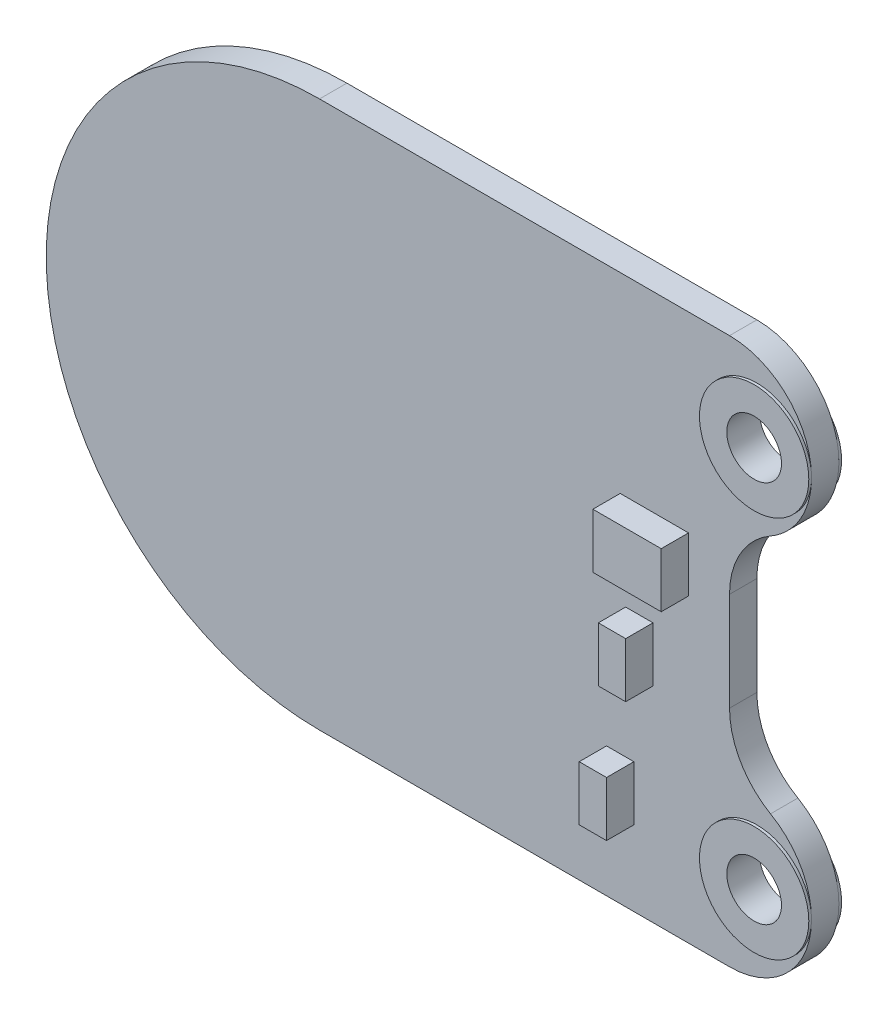
ISO-10303-21;
HEADER;
FILE_DESCRIPTION(('STEP AP214'),'2;1');
FILE_NAME('part.step','',(''),(''),'','','');
FILE_SCHEMA(('AUTOMOTIVE_DESIGN { 1 0 10303 214 1 1 1 1 }'));
ENDSEC;
DATA;
#1=APPLICATION_CONTEXT('core data for automotive mechanical design processes');
#2=APPLICATION_PROTOCOL_DEFINITION('international standard','automotive_design',2000,#1);
#3=PRODUCT_CONTEXT('',#1,'mechanical');
#4=PRODUCT('Part','Part','',(#3));
#5=PRODUCT_RELATED_PRODUCT_CATEGORY('part','',(#4));
#6=PRODUCT_DEFINITION_FORMATION('','',#4);
#7=PRODUCT_DEFINITION_CONTEXT('part definition',#1,'design');
#8=PRODUCT_DEFINITION('design','',#6,#7);
#9=PRODUCT_DEFINITION_SHAPE('','',#8);
#10=(LENGTH_UNIT() NAMED_UNIT(*) SI_UNIT(.MILLI.,.METRE.));
#11=(NAMED_UNIT(*) PLANE_ANGLE_UNIT() SI_UNIT($,.RADIAN.));
#12=(NAMED_UNIT(*) SI_UNIT($,.STERADIAN.) SOLID_ANGLE_UNIT());
#13=UNCERTAINTY_MEASURE_WITH_UNIT(LENGTH_MEASURE(1.E-05),#10,'distance_accuracy_value','');
#14=(GEOMETRIC_REPRESENTATION_CONTEXT(3) GLOBAL_UNCERTAINTY_ASSIGNED_CONTEXT((#13)) GLOBAL_UNIT_ASSIGNED_CONTEXT((#10,
#11,#12)) REPRESENTATION_CONTEXT('',''));
#15=CARTESIAN_POINT('',(0.,0.,0.));
#16=DIRECTION('',(0.,0.,1.));
#17=DIRECTION('',(1.,0.,0.));
#18=AXIS2_PLACEMENT_3D('',#15,#16,#17);
#19=CARTESIAN_POINT('',(11.,7.,1.));
#20=DIRECTION('',(0.,0.,1.));
#21=DIRECTION('',(1.,0.,0.));
#22=AXIS2_PLACEMENT_3D('',#19,#20,#21);
#23=PLANE('',#22);
#24=CARTESIAN_POINT('',(11.,-7.,1.));
#25=DIRECTION('',(0.,0.,1.));
#26=DIRECTION('',(1.,0.,0.));
#27=AXIS2_PLACEMENT_3D('',#24,#25,#26);
#28=CIRCLE('',#27,3.);
#29=CARTESIAN_POINT('',(11.,-10.,1.));
#30=VERTEX_POINT('',#29);
#31=CARTESIAN_POINT('',(14.,-7.,1.));
#32=VERTEX_POINT('',#31);
#33=EDGE_CURVE('E317',#30,#32,#28,.T.);
#34=ORIENTED_EDGE('',*,*,#33,.T.);
#35=CARTESIAN_POINT('',(12.,-7.,1.));
#36=DIRECTION('',(0.,0.,1.));
#37=DIRECTION('',(1.,0.,0.));
#38=AXIS2_PLACEMENT_3D('',#35,#36,#37);
#39=CIRCLE('',#38,2.);
#40=EDGE_CURVE('E291',#32,#32,#39,.T.);
#41=ORIENTED_EDGE('',*,*,#40,.F.);
#42=CARTESIAN_POINT('',(12.5,-4.40192378864668,1.));
#43=VERTEX_POINT('',#42);
#44=EDGE_CURVE('E316',#32,#43,#28,.T.);
#45=ORIENTED_EDGE('',*,*,#44,.T.);
#46=CARTESIAN_POINT('',(14.,-1.80384757729337,1.));
#47=DIRECTION('',(0.,0.,1.));
#48=DIRECTION('',(1.,0.,0.));
#49=AXIS2_PLACEMENT_3D('',#46,#47,#48);
#50=CIRCLE('',#49,3.);
#51=CARTESIAN_POINT('',(11.,-1.80384757729337,1.));
#52=VERTEX_POINT('',#51);
#53=EDGE_CURVE('E364',#43,#52,#50,.F.);
#54=ORIENTED_EDGE('',*,*,#53,.T.);
#55=DIRECTION('',(0.,1.,0.));
#56=VECTOR('',#55,1.);
#57=CARTESIAN_POINT('',(11.,4.,1.));
#58=LINE('',#57,#56);
#59=CARTESIAN_POINT('',(11.,1.80384757729337,1.));
#60=VERTEX_POINT('',#59);
#61=EDGE_CURVE('E319',#52,#60,#58,.T.);
#62=ORIENTED_EDGE('',*,*,#61,.T.);
#63=CARTESIAN_POINT('',(14.,1.80384757729337,1.));
#64=DIRECTION('',(0.,0.,1.));
#65=DIRECTION('',(1.,0.,0.));
#66=AXIS2_PLACEMENT_3D('',#63,#64,#65);
#67=CIRCLE('',#66,3.);
#68=CARTESIAN_POINT('',(12.5,4.40192378864669,1.));
#69=VERTEX_POINT('',#68);
#70=EDGE_CURVE('E11',#60,#69,#67,.F.);
#71=ORIENTED_EDGE('',*,*,#70,.T.);
#72=CARTESIAN_POINT('',(11.,7.,1.));
#73=DIRECTION('',(0.,0.,1.));
#74=DIRECTION('',(1.,0.,0.));
#75=AXIS2_PLACEMENT_3D('',#72,#73,#74);
#76=CIRCLE('',#75,3.);
#77=CARTESIAN_POINT('',(14.,7.,1.));
#78=VERTEX_POINT('',#77);
#79=EDGE_CURVE('E307',#69,#78,#76,.T.);
#80=ORIENTED_EDGE('',*,*,#79,.T.);
#81=CARTESIAN_POINT('',(12.,7.,1.));
#82=DIRECTION('',(0.,0.,1.));
#83=DIRECTION('',(1.,0.,0.));
#84=AXIS2_PLACEMENT_3D('',#81,#82,#83);
#85=CIRCLE('',#84,2.);
#86=EDGE_CURVE('E303',#78,#78,#85,.T.);
#87=ORIENTED_EDGE('',*,*,#86,.F.);
#88=CARTESIAN_POINT('',(11.,10.,1.));
#89=VERTEX_POINT('',#88);
#90=EDGE_CURVE('E310',#78,#89,#76,.T.);
#91=ORIENTED_EDGE('',*,*,#90,.T.);
#92=DIRECTION('',(-1.,0.,0.));
#93=VECTOR('',#92,1.);
#94=CARTESIAN_POINT('',(-4.,10.,1.));
#95=LINE('',#94,#93);
#96=CARTESIAN_POINT('',(-4.,10.,1.));
#97=VERTEX_POINT('',#96);
#98=EDGE_CURVE('E309',#89,#97,#95,.T.);
#99=ORIENTED_EDGE('',*,*,#98,.T.);
#100=CARTESIAN_POINT('',(-4.,0.,1.));
#101=DIRECTION('',(0.,0.,1.));
#102=DIRECTION('',(1.,0.,0.));
#103=AXIS2_PLACEMENT_3D('',#100,#101,#102);
#104=CIRCLE('',#103,10.);
#105=CARTESIAN_POINT('',(-4.,-10.,1.));
#106=VERTEX_POINT('',#105);
#107=EDGE_CURVE('E312',#97,#106,#104,.T.);
#108=ORIENTED_EDGE('',*,*,#107,.T.);
#109=DIRECTION('',(1.,0.,0.));
#110=VECTOR('',#109,1.);
#111=CARTESIAN_POINT('',(-4.,-10.,1.));
#112=LINE('',#111,#110);
#113=EDGE_CURVE('E314',#106,#30,#112,.T.);
#114=ORIENTED_EDGE('',*,*,#113,.T.);
#115=EDGE_LOOP('',(#34,#41,#45,#54,#62,#71,#80,#87,#91,#99,#108,#114));
#116=FACE_BOUND('',#115,.T.);
#117=DIRECTION('',(-1.,0.,0.));
#118=VECTOR('',#117,1.);
#119=CARTESIAN_POINT('',(7.,3.,1.));
#120=LINE('',#119,#118);
#121=CARTESIAN_POINT('',(9.50000000000001,3.,1.));
#122=VERTEX_POINT('',#121);
#123=CARTESIAN_POINT('',(7.,3.,1.));
#124=VERTEX_POINT('',#123);
#125=EDGE_CURVE('E258',#122,#124,#120,.T.);
#126=ORIENTED_EDGE('',*,*,#125,.F.);
#127=DIRECTION('',(0.,1.,0.));
#128=VECTOR('',#127,1.);
#129=CARTESIAN_POINT('',(9.50000000000001,3.,1.));
#130=LINE('',#129,#128);
#131=CARTESIAN_POINT('',(9.50000000000001,1.,1.));
#132=VERTEX_POINT('',#131);
#133=EDGE_CURVE('E244',#132,#122,#130,.T.);
#134=ORIENTED_EDGE('',*,*,#133,.F.);
#135=DIRECTION('',(1.,0.,0.));
#136=VECTOR('',#135,1.);
#137=CARTESIAN_POINT('',(7.,1.,1.));
#138=LINE('',#137,#136);
#139=CARTESIAN_POINT('',(7.,1.,1.));
#140=VERTEX_POINT('',#139);
#141=EDGE_CURVE('E249',#140,#132,#138,.T.);
#142=ORIENTED_EDGE('',*,*,#141,.F.);
#143=DIRECTION('',(0.,-1.,0.));
#144=VECTOR('',#143,1.);
#145=CARTESIAN_POINT('',(7.,3.,1.));
#146=LINE('',#145,#144);
#147=EDGE_CURVE('E260',#124,#140,#146,.T.);
#148=ORIENTED_EDGE('',*,*,#147,.F.);
#149=EDGE_LOOP('',(#126,#134,#142,#148));
#150=FACE_BOUND('',#149,.T.);
#151=DIRECTION('',(-1.,0.,0.));
#152=VECTOR('',#151,1.);
#153=CARTESIAN_POINT('',(7.2,-0.499999999999999,1.));
#154=LINE('',#153,#152);
#155=CARTESIAN_POINT('',(8.2,-0.499999999999999,1.));
#156=VERTEX_POINT('',#155);
#157=CARTESIAN_POINT('',(7.2,-0.499999999999999,1.));
#158=VERTEX_POINT('',#157);
#159=EDGE_CURVE('E216',#156,#158,#154,.T.);
#160=ORIENTED_EDGE('',*,*,#159,.F.);
#161=DIRECTION('',(0.,1.,0.));
#162=VECTOR('',#161,1.);
#163=CARTESIAN_POINT('',(8.2,-0.499999999999999,1.));
#164=LINE('',#163,#162);
#165=CARTESIAN_POINT('',(8.2,-2.5,1.));
#166=VERTEX_POINT('',#165);
#167=EDGE_CURVE('E213',#166,#156,#164,.T.);
#168=ORIENTED_EDGE('',*,*,#167,.F.);
#169=DIRECTION('',(1.,0.,0.));
#170=VECTOR('',#169,1.);
#171=CARTESIAN_POINT('',(7.2,-2.5,1.));
#172=LINE('',#171,#170);
#173=CARTESIAN_POINT('',(7.2,-2.5,1.));
#174=VERTEX_POINT('',#173);
#175=EDGE_CURVE('E225',#174,#166,#172,.T.);
#176=ORIENTED_EDGE('',*,*,#175,.F.);
#177=DIRECTION('',(0.,-1.,0.));
#178=VECTOR('',#177,1.);
#179=CARTESIAN_POINT('',(7.2,-0.499999999999999,1.));
#180=LINE('',#179,#178);
#181=EDGE_CURVE('E233',#158,#174,#180,.T.);
#182=ORIENTED_EDGE('',*,*,#181,.F.);
#183=EDGE_LOOP('',(#160,#168,#176,#182));
#184=FACE_BOUND('',#183,.T.);
#185=DIRECTION('',(-1.,0.,0.));
#186=VECTOR('',#185,1.);
#187=CARTESIAN_POINT('',(6.50000000000001,-5.25,1.));
#188=LINE('',#187,#186);
#189=CARTESIAN_POINT('',(7.50000000000001,-5.25,1.));
#190=VERTEX_POINT('',#189);
#191=CARTESIAN_POINT('',(6.50000000000001,-5.25,1.));
#192=VERTEX_POINT('',#191);
#193=EDGE_CURVE('E757',#190,#192,#188,.T.);
#194=ORIENTED_EDGE('',*,*,#193,.F.);
#195=DIRECTION('',(0.,1.,0.));
#196=VECTOR('',#195,1.);
#197=CARTESIAN_POINT('',(7.50000000000001,-5.25,1.));
#198=LINE('',#197,#196);
#199=CARTESIAN_POINT('',(7.50000000000001,-7.25,1.));
#200=VERTEX_POINT('',#199);
#201=EDGE_CURVE('E211',#200,#190,#198,.T.);
#202=ORIENTED_EDGE('',*,*,#201,.F.);
#203=DIRECTION('',(1.,0.,0.));
#204=VECTOR('',#203,1.);
#205=CARTESIAN_POINT('',(6.50000000000001,-7.25,1.));
#206=LINE('',#205,#204);
#207=CARTESIAN_POINT('',(6.50000000000001,-7.25,1.));
#208=VERTEX_POINT('',#207);
#209=EDGE_CURVE('E207',#208,#200,#206,.T.);
#210=ORIENTED_EDGE('',*,*,#209,.F.);
#211=DIRECTION('',(0.,-1.,0.));
#212=VECTOR('',#211,1.);
#213=CARTESIAN_POINT('',(6.50000000000001,-5.25,1.));
#214=LINE('',#213,#212);
#215=EDGE_CURVE('E754',#192,#208,#214,.T.);
#216=ORIENTED_EDGE('',*,*,#215,.F.);
#217=EDGE_LOOP('',(#194,#202,#210,#216));
#218=FACE_BOUND('',#217,.T.);
#219=ADVANCED_FACE('F38',(#116,#150,#184,#218),#23,.T.);
#220=CARTESIAN_POINT('',(12.,7.,-0.1));
#221=DIRECTION('',(0.,0.,1.));
#222=DIRECTION('',(1.,0.,0.));
#223=AXIS2_PLACEMENT_3D('',#220,#221,#222);
#224=CYLINDRICAL_SURFACE('',#223,2.);
#225=ORIENTED_EDGE('',*,*,#86,.T.);
#226=EDGE_LOOP('',(#225));
#227=FACE_BOUND('',#226,.T.);
#228=CARTESIAN_POINT('',(12.,7.,1.1));
#229=DIRECTION('',(0.,0.,1.));
#230=DIRECTION('',(1.,0.,0.));
#231=AXIS2_PLACEMENT_3D('',#228,#229,#230);
#232=CIRCLE('',#231,2.);
#233=CARTESIAN_POINT('',(14.,7.,1.1));
#234=VERTEX_POINT('',#233);
#235=EDGE_CURVE('E294',#234,#234,#232,.T.);
#236=ORIENTED_EDGE('',*,*,#235,.F.);
#237=EDGE_LOOP('',(#236));
#238=FACE_BOUND('',#237,.T.);
#239=ADVANCED_FACE('F389',(#227,#238),#224,.T.);
#240=CARTESIAN_POINT('',(12.,7.,1.1));
#241=DIRECTION('',(0.,0.,1.));
#242=DIRECTION('',(1.,0.,0.));
#243=AXIS2_PLACEMENT_3D('',#240,#241,#242);
#244=PLANE('',#243);
#245=CARTESIAN_POINT('',(12.,7.,1.1));
#246=DIRECTION('',(0.,0.,1.));
#247=DIRECTION('',(1.,0.,0.));
#248=AXIS2_PLACEMENT_3D('',#245,#246,#247);
#249=CIRCLE('',#248,1.);
#250=CARTESIAN_POINT('',(13.,7.,1.1));
#251=VERTEX_POINT('',#250);
#252=EDGE_CURVE('E274',#251,#251,#249,.T.);
#253=ORIENTED_EDGE('',*,*,#252,.F.);
#254=EDGE_LOOP('',(#253));
#255=FACE_BOUND('',#254,.T.);
#256=ORIENTED_EDGE('',*,*,#235,.T.);
#257=EDGE_LOOP('',(#256));
#258=FACE_BOUND('',#257,.T.);
#259=ADVANCED_FACE('F392',(#255,#258),#244,.T.);
#260=CARTESIAN_POINT('',(11.,7.,0.));
#261=DIRECTION('',(0.,0.,1.));
#262=DIRECTION('',(1.,0.,0.));
#263=AXIS2_PLACEMENT_3D('',#260,#261,#262);
#264=PLANE('',#263);
#265=CARTESIAN_POINT('',(11.,-7.,0.));
#266=DIRECTION('',(0.,0.,1.));
#267=DIRECTION('',(1.,0.,0.));
#268=AXIS2_PLACEMENT_3D('',#265,#266,#267);
#269=CIRCLE('',#268,3.);
#270=CARTESIAN_POINT('',(14.,-7.,0.));
#271=VERTEX_POINT('',#270);
#272=CARTESIAN_POINT('',(12.5,-4.40192378864668,0.));
#273=VERTEX_POINT('',#272);
#274=EDGE_CURVE('E332',#271,#273,#269,.T.);
#275=ORIENTED_EDGE('',*,*,#274,.F.);
#276=CARTESIAN_POINT('',(12.,-7.,0.));
#277=DIRECTION('',(0.,0.,1.));
#278=DIRECTION('',(1.,0.,0.));
#279=AXIS2_PLACEMENT_3D('',#276,#277,#278);
#280=CIRCLE('',#279,2.);
#281=EDGE_CURVE('E288',#271,#271,#280,.T.);
#282=ORIENTED_EDGE('',*,*,#281,.T.);
#283=CARTESIAN_POINT('',(11.,-10.,0.));
#284=VERTEX_POINT('',#283);
#285=EDGE_CURVE('E333',#284,#271,#269,.T.);
#286=ORIENTED_EDGE('',*,*,#285,.F.);
#287=DIRECTION('',(1.,0.,0.));
#288=VECTOR('',#287,1.);
#289=CARTESIAN_POINT('',(-4.,-10.,0.));
#290=LINE('',#289,#288);
#291=CARTESIAN_POINT('',(-4.,-10.,0.));
#292=VERTEX_POINT('',#291);
#293=EDGE_CURVE('E330',#292,#284,#290,.T.);
#294=ORIENTED_EDGE('',*,*,#293,.F.);
#295=CARTESIAN_POINT('',(-4.,0.,0.));
#296=DIRECTION('',(0.,0.,1.));
#297=DIRECTION('',(1.,0.,0.));
#298=AXIS2_PLACEMENT_3D('',#295,#296,#297);
#299=CIRCLE('',#298,10.);
#300=CARTESIAN_POINT('',(-4.,10.,0.));
#301=VERTEX_POINT('',#300);
#302=EDGE_CURVE('E328',#301,#292,#299,.T.);
#303=ORIENTED_EDGE('',*,*,#302,.F.);
#304=DIRECTION('',(-1.,0.,0.));
#305=VECTOR('',#304,1.);
#306=CARTESIAN_POINT('',(-4.,10.,0.));
#307=LINE('',#306,#305);
#308=CARTESIAN_POINT('',(11.,10.,0.));
#309=VERTEX_POINT('',#308);
#310=EDGE_CURVE('E326',#309,#301,#307,.T.);
#311=ORIENTED_EDGE('',*,*,#310,.F.);
#312=CARTESIAN_POINT('',(11.,7.,0.));
#313=DIRECTION('',(0.,0.,1.));
#314=DIRECTION('',(1.,0.,0.));
#315=AXIS2_PLACEMENT_3D('',#312,#313,#314);
#316=CIRCLE('',#315,3.);
#317=CARTESIAN_POINT('',(14.,7.,0.));
#318=VERTEX_POINT('',#317);
#319=EDGE_CURVE('E306',#318,#309,#316,.T.);
#320=ORIENTED_EDGE('',*,*,#319,.F.);
#321=CARTESIAN_POINT('',(12.,7.,0.));
#322=DIRECTION('',(0.,0.,1.));
#323=DIRECTION('',(1.,0.,0.));
#324=AXIS2_PLACEMENT_3D('',#321,#322,#323);
#325=CIRCLE('',#324,2.);
#326=EDGE_CURVE('E300',#318,#318,#325,.T.);
#327=ORIENTED_EDGE('',*,*,#326,.T.);
#328=CARTESIAN_POINT('',(12.5,4.40192378864669,0.));
#329=VERTEX_POINT('',#328);
#330=EDGE_CURVE('E323',#329,#318,#316,.T.);
#331=ORIENTED_EDGE('',*,*,#330,.F.);
#332=CARTESIAN_POINT('',(14.,1.80384757729337,0.));
#333=DIRECTION('',(0.,0.,1.));
#334=DIRECTION('',(1.,0.,0.));
#335=AXIS2_PLACEMENT_3D('',#332,#333,#334);
#336=CIRCLE('',#335,3.);
#337=CARTESIAN_POINT('',(11.,1.80384757729337,0.));
#338=VERTEX_POINT('',#337);
#339=EDGE_CURVE('E47',#329,#338,#336,.T.);
#340=ORIENTED_EDGE('',*,*,#339,.T.);
#341=DIRECTION('',(0.,1.,0.));
#342=VECTOR('',#341,1.);
#343=CARTESIAN_POINT('',(11.,4.,0.));
#344=LINE('',#343,#342);
#345=CARTESIAN_POINT('',(11.,-1.80384757729337,0.));
#346=VERTEX_POINT('',#345);
#347=EDGE_CURVE('E336',#346,#338,#344,.T.);
#348=ORIENTED_EDGE('',*,*,#347,.F.);
#349=CARTESIAN_POINT('',(14.,-1.80384757729337,0.));
#350=DIRECTION('',(0.,0.,1.));
#351=DIRECTION('',(1.,0.,0.));
#352=AXIS2_PLACEMENT_3D('',#349,#350,#351);
#353=CIRCLE('',#352,3.);
#354=EDGE_CURVE('E361',#346,#273,#353,.T.);
#355=ORIENTED_EDGE('',*,*,#354,.T.);
#356=EDGE_LOOP('',(#275,#282,#286,#294,#303,#311,#320,#327,#331,#340,#348,#355));
#357=FACE_BOUND('',#356,.T.);
#358=ADVANCED_FACE('F370',(#357),#264,.F.);
#359=CARTESIAN_POINT('',(11.,7.,1.));
#360=DIRECTION('',(0.,0.,-1.));
#361=DIRECTION('',(-1.,0.,0.));
#362=AXIS2_PLACEMENT_3D('',#359,#360,#361);
#363=CYLINDRICAL_SURFACE('',#362,3.);
#364=ORIENTED_EDGE('',*,*,#330,.T.);
#365=ORIENTED_EDGE('',*,*,#319,.T.);
#366=DIRECTION('',(0.,0.,-1.));
#367=VECTOR('',#366,1.);
#368=CARTESIAN_POINT('',(11.,10.,1.));
#369=LINE('',#368,#367);
#370=EDGE_CURVE('E347',#89,#309,#369,.T.);
#371=ORIENTED_EDGE('',*,*,#370,.F.);
#372=ORIENTED_EDGE('',*,*,#90,.F.);
#373=ORIENTED_EDGE('',*,*,#79,.F.);
#374=DIRECTION('',(0.,0.,-1.));
#375=VECTOR('',#374,1.);
#376=CARTESIAN_POINT('',(12.5,4.40192378864669,1.));
#377=LINE('',#376,#375);
#378=EDGE_CURVE('E358',#69,#329,#377,.T.);
#379=ORIENTED_EDGE('',*,*,#378,.T.);
#380=EDGE_LOOP('',(#364,#365,#371,#372,#373,#379));
#381=FACE_BOUND('',#380,.T.);
#382=ADVANCED_FACE('F385',(#381),#363,.T.);
#383=CARTESIAN_POINT('',(-4.,10.,1.));
#384=DIRECTION('',(0.,-1.,0.));
#385=DIRECTION('',(0.,0.,-1.));
#386=AXIS2_PLACEMENT_3D('',#383,#384,#385);
#387=PLANE('',#386);
#388=ORIENTED_EDGE('',*,*,#310,.T.);
#389=DIRECTION('',(0.,0.,-1.));
#390=VECTOR('',#389,1.);
#391=CARTESIAN_POINT('',(-4.,10.,1.));
#392=LINE('',#391,#390);
#393=EDGE_CURVE('E344',#97,#301,#392,.T.);
#394=ORIENTED_EDGE('',*,*,#393,.F.);
#395=ORIENTED_EDGE('',*,*,#98,.F.);
#396=ORIENTED_EDGE('',*,*,#370,.T.);
#397=EDGE_LOOP('',(#388,#394,#395,#396));
#398=FACE_BOUND('',#397,.T.);
#399=ADVANCED_FACE('F426',(#398),#387,.F.);
#400=CARTESIAN_POINT('',(-4.,0.,1.));
#401=DIRECTION('',(0.,0.,-1.));
#402=DIRECTION('',(-1.,0.,0.));
#403=AXIS2_PLACEMENT_3D('',#400,#401,#402);
#404=CYLINDRICAL_SURFACE('',#403,10.);
#405=ORIENTED_EDGE('',*,*,#302,.T.);
#406=DIRECTION('',(0.,0.,-1.));
#407=VECTOR('',#406,1.);
#408=CARTESIAN_POINT('',(-4.,-10.,1.));
#409=LINE('',#408,#407);
#410=EDGE_CURVE('E341',#106,#292,#409,.T.);
#411=ORIENTED_EDGE('',*,*,#410,.F.);
#412=ORIENTED_EDGE('',*,*,#107,.F.);
#413=ORIENTED_EDGE('',*,*,#393,.T.);
#414=EDGE_LOOP('',(#405,#411,#412,#413));
#415=FACE_BOUND('',#414,.T.);
#416=ADVANCED_FACE('F422',(#415),#404,.T.);
#417=CARTESIAN_POINT('',(-4.,-10.,1.));
#418=DIRECTION('',(0.,1.,0.));
#419=DIRECTION('',(0.,0.,1.));
#420=AXIS2_PLACEMENT_3D('',#417,#418,#419);
#421=PLANE('',#420);
#422=ORIENTED_EDGE('',*,*,#293,.T.);
#423=DIRECTION('',(0.,0.,-1.));
#424=VECTOR('',#423,1.);
#425=CARTESIAN_POINT('',(11.,-10.,1.));
#426=LINE('',#425,#424);
#427=EDGE_CURVE('E322',#30,#284,#426,.T.);
#428=ORIENTED_EDGE('',*,*,#427,.F.);
#429=ORIENTED_EDGE('',*,*,#113,.F.);
#430=ORIENTED_EDGE('',*,*,#410,.T.);
#431=EDGE_LOOP('',(#422,#428,#429,#430));
#432=FACE_BOUND('',#431,.T.);
#433=ADVANCED_FACE('F418',(#432),#421,.F.);
#434=CARTESIAN_POINT('',(11.,-7.,1.));
#435=DIRECTION('',(0.,0.,-1.));
#436=DIRECTION('',(-1.,0.,0.));
#437=AXIS2_PLACEMENT_3D('',#434,#435,#436);
#438=CYLINDRICAL_SURFACE('',#437,3.);
#439=ORIENTED_EDGE('',*,*,#285,.T.);
#440=ORIENTED_EDGE('',*,*,#274,.T.);
#441=DIRECTION('',(0.,0.,-1.));
#442=VECTOR('',#441,1.);
#443=CARTESIAN_POINT('',(12.5,-4.40192378864668,1.));
#444=LINE('',#443,#442);
#445=EDGE_CURVE('E355',#273,#43,#444,.F.);
#446=ORIENTED_EDGE('',*,*,#445,.T.);
#447=ORIENTED_EDGE('',*,*,#44,.F.);
#448=ORIENTED_EDGE('',*,*,#33,.F.);
#449=ORIENTED_EDGE('',*,*,#427,.T.);
#450=EDGE_LOOP('',(#439,#440,#446,#447,#448,#449));
#451=FACE_BOUND('',#450,.T.);
#452=ADVANCED_FACE('F415',(#451),#438,.T.);
#453=CARTESIAN_POINT('',(11.,4.,1.));
#454=DIRECTION('',(-1.,0.,0.));
#455=DIRECTION('',(0.,-1.,0.));
#456=AXIS2_PLACEMENT_3D('',#453,#454,#455);
#457=PLANE('',#456);
#458=ORIENTED_EDGE('',*,*,#61,.F.);
#459=DIRECTION('',(0.,0.,1.));
#460=VECTOR('',#459,1.);
#461=CARTESIAN_POINT('',(11.,-1.80384757729337,0.));
#462=LINE('',#461,#460);
#463=EDGE_CURVE('E352',#52,#346,#462,.F.);
#464=ORIENTED_EDGE('',*,*,#463,.T.);
#465=ORIENTED_EDGE('',*,*,#347,.T.);
#466=DIRECTION('',(0.,0.,1.));
#467=VECTOR('',#466,1.);
#468=CARTESIAN_POINT('',(11.,1.80384757729337,1.));
#469=LINE('',#468,#467);
#470=EDGE_CURVE('E350',#338,#60,#469,.T.);
#471=ORIENTED_EDGE('',*,*,#470,.T.);
#472=EDGE_LOOP('',(#458,#464,#465,#471));
#473=FACE_BOUND('',#472,.T.);
#474=ADVANCED_FACE('F376',(#473),#457,.F.);
#475=CARTESIAN_POINT('',(14.,-1.80384757729337,1.));
#476=DIRECTION('',(0.,0.,-1.));
#477=DIRECTION('',(-1.,0.,0.));
#478=AXIS2_PLACEMENT_3D('',#475,#476,#477);
#479=CYLINDRICAL_SURFACE('',#478,3.);
#480=ORIENTED_EDGE('',*,*,#53,.F.);
#481=ORIENTED_EDGE('',*,*,#445,.F.);
#482=ORIENTED_EDGE('',*,*,#354,.F.);
#483=ORIENTED_EDGE('',*,*,#463,.F.);
#484=EDGE_LOOP('',(#480,#481,#482,#483));
#485=FACE_BOUND('',#484,.T.);
#486=ADVANCED_FACE('F414',(#485),#479,.F.);
#487=CARTESIAN_POINT('',(14.,1.80384757729337,1.));
#488=DIRECTION('',(0.,0.,-1.));
#489=DIRECTION('',(-1.,0.,0.));
#490=AXIS2_PLACEMENT_3D('',#487,#488,#489);
#491=CYLINDRICAL_SURFACE('',#490,3.);
#492=ORIENTED_EDGE('',*,*,#70,.F.);
#493=ORIENTED_EDGE('',*,*,#470,.F.);
#494=ORIENTED_EDGE('',*,*,#339,.F.);
#495=ORIENTED_EDGE('',*,*,#378,.F.);
#496=EDGE_LOOP('',(#492,#493,#494,#495));
#497=FACE_BOUND('',#496,.T.);
#498=ADVANCED_FACE('F40',(#497),#491,.F.);
#499=CARTESIAN_POINT('',(12.,7.,-0.1));
#500=DIRECTION('',(0.,0.,1.));
#501=DIRECTION('',(1.,0.,0.));
#502=AXIS2_PLACEMENT_3D('',#499,#500,#501);
#503=PLANE('',#502);
#504=CARTESIAN_POINT('',(12.,7.,-0.1));
#505=DIRECTION('',(0.,0.,1.));
#506=DIRECTION('',(1.,0.,0.));
#507=AXIS2_PLACEMENT_3D('',#504,#505,#506);
#508=CIRCLE('',#507,1.);
#509=CARTESIAN_POINT('',(13.,7.,-0.1));
#510=VERTEX_POINT('',#509);
#511=EDGE_CURVE('E42',#510,#510,#508,.T.);
#512=ORIENTED_EDGE('',*,*,#511,.T.);
#513=EDGE_LOOP('',(#512));
#514=FACE_BOUND('',#513,.T.);
#515=CARTESIAN_POINT('',(12.,7.,-0.1));
#516=DIRECTION('',(0.,0.,1.));
#517=DIRECTION('',(1.,0.,0.));
#518=AXIS2_PLACEMENT_3D('',#515,#516,#517);
#519=CIRCLE('',#518,2.);
#520=CARTESIAN_POINT('',(14.,7.,-0.1));
#521=VERTEX_POINT('',#520);
#522=EDGE_CURVE('E297',#521,#521,#519,.T.);
#523=ORIENTED_EDGE('',*,*,#522,.F.);
#524=EDGE_LOOP('',(#523));
#525=FACE_BOUND('',#524,.T.);
#526=ADVANCED_FACE('F437',(#514,#525),#503,.F.);
#527=ORIENTED_EDGE('',*,*,#522,.T.);
#528=EDGE_LOOP('',(#527));
#529=FACE_BOUND('',#528,.T.);
#530=ORIENTED_EDGE('',*,*,#326,.F.);
#531=EDGE_LOOP('',(#530));
#532=FACE_BOUND('',#531,.T.);
#533=ADVANCED_FACE('F394',(#529,#532),#224,.T.);
#534=CARTESIAN_POINT('',(12.,-7.,-0.1));
#535=DIRECTION('',(0.,0.,1.));
#536=DIRECTION('',(1.,0.,0.));
#537=AXIS2_PLACEMENT_3D('',#534,#535,#536);
#538=PLANE('',#537);
#539=CARTESIAN_POINT('',(12.,-7.,-0.1));
#540=DIRECTION('',(0.,0.,1.));
#541=DIRECTION('',(1.,0.,0.));
#542=AXIS2_PLACEMENT_3D('',#539,#540,#541);
#543=CIRCLE('',#542,1.);
#544=CARTESIAN_POINT('',(13.,-7.,-0.1));
#545=VERTEX_POINT('',#544);
#546=EDGE_CURVE('E277',#545,#545,#543,.T.);
#547=ORIENTED_EDGE('',*,*,#546,.T.);
#548=EDGE_LOOP('',(#547));
#549=FACE_BOUND('',#548,.T.);
#550=CARTESIAN_POINT('',(12.,-7.,-0.1));
#551=DIRECTION('',(0.,0.,1.));
#552=DIRECTION('',(1.,0.,0.));
#553=AXIS2_PLACEMENT_3D('',#550,#551,#552);
#554=CIRCLE('',#553,2.);
#555=CARTESIAN_POINT('',(14.,-7.,-0.1));
#556=VERTEX_POINT('',#555);
#557=EDGE_CURVE('E282',#556,#556,#554,.T.);
#558=ORIENTED_EDGE('',*,*,#557,.F.);
#559=EDGE_LOOP('',(#558));
#560=FACE_BOUND('',#559,.T.);
#561=ADVANCED_FACE('F449',(#549,#560),#538,.F.);
#562=CARTESIAN_POINT('',(12.,-7.,-0.1));
#563=DIRECTION('',(0.,0.,1.));
#564=DIRECTION('',(1.,0.,0.));
#565=AXIS2_PLACEMENT_3D('',#562,#563,#564);
#566=CYLINDRICAL_SURFACE('',#565,2.);
#567=ORIENTED_EDGE('',*,*,#557,.T.);
#568=EDGE_LOOP('',(#567));
#569=FACE_BOUND('',#568,.T.);
#570=ORIENTED_EDGE('',*,*,#281,.F.);
#571=EDGE_LOOP('',(#570));
#572=FACE_BOUND('',#571,.T.);
#573=ADVANCED_FACE('F446',(#569,#572),#566,.T.);
#574=ORIENTED_EDGE('',*,*,#40,.T.);
#575=EDGE_LOOP('',(#574));
#576=FACE_BOUND('',#575,.T.);
#577=CARTESIAN_POINT('',(12.,-7.,1.1));
#578=DIRECTION('',(0.,0.,1.));
#579=DIRECTION('',(1.,0.,0.));
#580=AXIS2_PLACEMENT_3D('',#577,#578,#579);
#581=CIRCLE('',#580,2.);
#582=CARTESIAN_POINT('',(14.,-7.,1.1));
#583=VERTEX_POINT('',#582);
#584=EDGE_CURVE('E285',#583,#583,#581,.T.);
#585=ORIENTED_EDGE('',*,*,#584,.F.);
#586=EDGE_LOOP('',(#585));
#587=FACE_BOUND('',#586,.T.);
#588=ADVANCED_FACE('F448',(#576,#587),#566,.T.);
#589=CARTESIAN_POINT('',(12.,-7.,1.1));
#590=DIRECTION('',(0.,0.,1.));
#591=DIRECTION('',(1.,0.,0.));
#592=AXIS2_PLACEMENT_3D('',#589,#590,#591);
#593=PLANE('',#592);
#594=CARTESIAN_POINT('',(12.,-7.,1.1));
#595=DIRECTION('',(0.,0.,1.));
#596=DIRECTION('',(1.,0.,0.));
#597=AXIS2_PLACEMENT_3D('',#594,#595,#596);
#598=CIRCLE('',#597,1.);
#599=CARTESIAN_POINT('',(13.,-7.,1.1));
#600=VERTEX_POINT('',#599);
#601=EDGE_CURVE('E273',#600,#600,#598,.T.);
#602=ORIENTED_EDGE('',*,*,#601,.F.);
#603=EDGE_LOOP('',(#602));
#604=FACE_BOUND('',#603,.T.);
#605=ORIENTED_EDGE('',*,*,#584,.T.);
#606=EDGE_LOOP('',(#605));
#607=FACE_BOUND('',#606,.T.);
#608=ADVANCED_FACE('F456',(#604,#607),#593,.T.);
#609=CARTESIAN_POINT('',(12.,-7.,-0.9));
#610=DIRECTION('',(0.,0.,1.));
#611=DIRECTION('',(1.,0.,0.));
#612=AXIS2_PLACEMENT_3D('',#609,#610,#611);
#613=CYLINDRICAL_SURFACE('',#612,1.);
#614=ORIENTED_EDGE('',*,*,#601,.T.);
#615=EDGE_LOOP('',(#614));
#616=FACE_BOUND('',#615,.T.);
#617=ORIENTED_EDGE('',*,*,#546,.F.);
#618=EDGE_LOOP('',(#617));
#619=FACE_BOUND('',#618,.T.);
#620=ADVANCED_FACE('F461',(#616,#619),#613,.F.);
#621=CARTESIAN_POINT('',(12.,7.,-0.9));
#622=DIRECTION('',(0.,0.,1.));
#623=DIRECTION('',(1.,0.,0.));
#624=AXIS2_PLACEMENT_3D('',#621,#622,#623);
#625=CYLINDRICAL_SURFACE('',#624,1.);
#626=ORIENTED_EDGE('',*,*,#252,.T.);
#627=EDGE_LOOP('',(#626));
#628=FACE_BOUND('',#627,.T.);
#629=ORIENTED_EDGE('',*,*,#511,.F.);
#630=EDGE_LOOP('',(#629));
#631=FACE_BOUND('',#630,.T.);
#632=ADVANCED_FACE('F468',(#628,#631),#625,.F.);
#633=CARTESIAN_POINT('',(9.50000000000001,3.,2.));
#634=DIRECTION('',(-1.,0.,0.));
#635=DIRECTION('',(0.,-1.,0.));
#636=AXIS2_PLACEMENT_3D('',#633,#634,#635);
#637=PLANE('',#636);
#638=ORIENTED_EDGE('',*,*,#133,.T.);
#639=DIRECTION('',(0.,0.,-1.));
#640=VECTOR('',#639,1.);
#641=CARTESIAN_POINT('',(9.50000000000001,3.,2.));
#642=LINE('',#641,#640);
#643=CARTESIAN_POINT('',(9.50000000000001,3.,2.));
#644=VERTEX_POINT('',#643);
#645=EDGE_CURVE('E271',#644,#122,#642,.T.);
#646=ORIENTED_EDGE('',*,*,#645,.F.);
#647=DIRECTION('',(0.,1.,0.));
#648=VECTOR('',#647,1.);
#649=CARTESIAN_POINT('',(9.50000000000001,3.,2.));
#650=LINE('',#649,#648);
#651=CARTESIAN_POINT('',(9.50000000000001,1.,2.));
#652=VERTEX_POINT('',#651);
#653=EDGE_CURVE('E245',#652,#644,#650,.T.);
#654=ORIENTED_EDGE('',*,*,#653,.F.);
#655=DIRECTION('',(0.,0.,-1.));
#656=VECTOR('',#655,1.);
#657=CARTESIAN_POINT('',(9.50000000000001,1.,2.));
#658=LINE('',#657,#656);
#659=EDGE_CURVE('E255',#652,#132,#658,.T.);
#660=ORIENTED_EDGE('',*,*,#659,.T.);
#661=EDGE_LOOP('',(#638,#646,#654,#660));
#662=FACE_BOUND('',#661,.T.);
#663=ADVANCED_FACE('F481',(#662),#637,.F.);
#664=CARTESIAN_POINT('',(7.,3.,2.));
#665=DIRECTION('',(0.,-1.,0.));
#666=DIRECTION('',(0.,0.,-1.));
#667=AXIS2_PLACEMENT_3D('',#664,#665,#666);
#668=PLANE('',#667);
#669=ORIENTED_EDGE('',*,*,#125,.T.);
#670=DIRECTION('',(0.,0.,-1.));
#671=VECTOR('',#670,1.);
#672=CARTESIAN_POINT('',(7.,3.,2.));
#673=LINE('',#672,#671);
#674=CARTESIAN_POINT('',(7.,3.,2.));
#675=VERTEX_POINT('',#674);
#676=EDGE_CURVE('E268',#675,#124,#673,.T.);
#677=ORIENTED_EDGE('',*,*,#676,.F.);
#678=DIRECTION('',(-1.,0.,0.));
#679=VECTOR('',#678,1.);
#680=CARTESIAN_POINT('',(7.,3.,2.));
#681=LINE('',#680,#679);
#682=EDGE_CURVE('E248',#644,#675,#681,.T.);
#683=ORIENTED_EDGE('',*,*,#682,.F.);
#684=ORIENTED_EDGE('',*,*,#645,.T.);
#685=EDGE_LOOP('',(#669,#677,#683,#684));
#686=FACE_BOUND('',#685,.T.);
#687=ADVANCED_FACE('F486',(#686),#668,.F.);
#688=CARTESIAN_POINT('',(7.,3.,2.));
#689=DIRECTION('',(1.,0.,0.));
#690=DIRECTION('',(0.,0.,-1.));
#691=AXIS2_PLACEMENT_3D('',#688,#689,#690);
#692=PLANE('',#691);
#693=ORIENTED_EDGE('',*,*,#147,.T.);
#694=DIRECTION('',(0.,0.,-1.));
#695=VECTOR('',#694,1.);
#696=CARTESIAN_POINT('',(7.,1.,2.));
#697=LINE('',#696,#695);
#698=CARTESIAN_POINT('',(7.,1.,2.));
#699=VERTEX_POINT('',#698);
#700=EDGE_CURVE('E266',#699,#140,#697,.T.);
#701=ORIENTED_EDGE('',*,*,#700,.F.);
#702=DIRECTION('',(0.,-1.,0.));
#703=VECTOR('',#702,1.);
#704=CARTESIAN_POINT('',(7.,3.,2.));
#705=LINE('',#704,#703);
#706=EDGE_CURVE('E251',#675,#699,#705,.T.);
#707=ORIENTED_EDGE('',*,*,#706,.F.);
#708=ORIENTED_EDGE('',*,*,#676,.T.);
#709=EDGE_LOOP('',(#693,#701,#707,#708));
#710=FACE_BOUND('',#709,.T.);
#711=ADVANCED_FACE('F493',(#710),#692,.F.);
#712=CARTESIAN_POINT('',(7.,1.,2.));
#713=DIRECTION('',(0.,1.,0.));
#714=DIRECTION('',(0.,0.,1.));
#715=AXIS2_PLACEMENT_3D('',#712,#713,#714);
#716=PLANE('',#715);
#717=ORIENTED_EDGE('',*,*,#141,.T.);
#718=ORIENTED_EDGE('',*,*,#659,.F.);
#719=DIRECTION('',(1.,0.,0.));
#720=VECTOR('',#719,1.);
#721=CARTESIAN_POINT('',(7.,1.,2.));
#722=LINE('',#721,#720);
#723=EDGE_CURVE('E253',#699,#652,#722,.T.);
#724=ORIENTED_EDGE('',*,*,#723,.F.);
#725=ORIENTED_EDGE('',*,*,#700,.T.);
#726=EDGE_LOOP('',(#717,#718,#724,#725));
#727=FACE_BOUND('',#726,.T.);
#728=ADVANCED_FACE('F497',(#727),#716,.F.);
#729=CARTESIAN_POINT('',(0.,0.,2.));
#730=DIRECTION('',(0.,0.,1.));
#731=DIRECTION('',(1.,0.,0.));
#732=AXIS2_PLACEMENT_3D('',#729,#730,#731);
#733=PLANE('',#732);
#734=ORIENTED_EDGE('',*,*,#653,.T.);
#735=ORIENTED_EDGE('',*,*,#682,.T.);
#736=ORIENTED_EDGE('',*,*,#706,.T.);
#737=ORIENTED_EDGE('',*,*,#723,.T.);
#738=EDGE_LOOP('',(#734,#735,#736,#737));
#739=FACE_BOUND('',#738,.T.);
#740=ADVANCED_FACE('F501',(#739),#733,.T.);
#741=CARTESIAN_POINT('',(8.2,-0.499999999999999,2.));
#742=DIRECTION('',(-1.,0.,0.));
#743=DIRECTION('',(0.,0.,1.));
#744=AXIS2_PLACEMENT_3D('',#741,#742,#743);
#745=PLANE('',#744);
#746=ORIENTED_EDGE('',*,*,#167,.T.);
#747=DIRECTION('',(0.,0.,-1.));
#748=VECTOR('',#747,1.);
#749=CARTESIAN_POINT('',(8.2,-0.499999999999999,2.));
#750=LINE('',#749,#748);
#751=CARTESIAN_POINT('',(8.2,-0.499999999999999,2.));
#752=VERTEX_POINT('',#751);
#753=EDGE_CURVE('E242',#752,#156,#750,.T.);
#754=ORIENTED_EDGE('',*,*,#753,.F.);
#755=DIRECTION('',(0.,1.,0.));
#756=VECTOR('',#755,1.);
#757=CARTESIAN_POINT('',(8.2,-0.499999999999999,2.));
#758=LINE('',#757,#756);
#759=CARTESIAN_POINT('',(8.2,-2.5,2.));
#760=VERTEX_POINT('',#759);
#761=EDGE_CURVE('E221',#760,#752,#758,.T.);
#762=ORIENTED_EDGE('',*,*,#761,.F.);
#763=DIRECTION('',(0.,0.,-1.));
#764=VECTOR('',#763,1.);
#765=CARTESIAN_POINT('',(8.2,-2.5,2.));
#766=LINE('',#765,#764);
#767=EDGE_CURVE('E230',#760,#166,#766,.T.);
#768=ORIENTED_EDGE('',*,*,#767,.T.);
#769=EDGE_LOOP('',(#746,#754,#762,#768));
#770=FACE_BOUND('',#769,.T.);
#771=ADVANCED_FACE('F505',(#770),#745,.F.);
#772=CARTESIAN_POINT('',(7.2,-0.499999999999999,2.));
#773=DIRECTION('',(0.,-1.,0.));
#774=DIRECTION('',(0.,0.,-1.));
#775=AXIS2_PLACEMENT_3D('',#772,#773,#774);
#776=PLANE('',#775);
#777=ORIENTED_EDGE('',*,*,#159,.T.);
#778=DIRECTION('',(0.,0.,-1.));
#779=VECTOR('',#778,1.);
#780=CARTESIAN_POINT('',(7.2,-0.499999999999999,2.));
#781=LINE('',#780,#779);
#782=CARTESIAN_POINT('',(7.2,-0.499999999999999,2.));
#783=VERTEX_POINT('',#782);
#784=EDGE_CURVE('E239',#783,#158,#781,.T.);
#785=ORIENTED_EDGE('',*,*,#784,.F.);
#786=DIRECTION('',(-1.,0.,0.));
#787=VECTOR('',#786,1.);
#788=CARTESIAN_POINT('',(7.2,-0.499999999999999,2.));
#789=LINE('',#788,#787);
#790=EDGE_CURVE('E224',#752,#783,#789,.T.);
#791=ORIENTED_EDGE('',*,*,#790,.F.);
#792=ORIENTED_EDGE('',*,*,#753,.T.);
#793=EDGE_LOOP('',(#777,#785,#791,#792));
#794=FACE_BOUND('',#793,.T.);
#795=ADVANCED_FACE('F509',(#794),#776,.F.);
#796=CARTESIAN_POINT('',(7.2,-0.499999999999999,2.));
#797=DIRECTION('',(1.,0.,0.));
#798=DIRECTION('',(0.,0.,-1.));
#799=AXIS2_PLACEMENT_3D('',#796,#797,#798);
#800=PLANE('',#799);
#801=ORIENTED_EDGE('',*,*,#181,.T.);
#802=DIRECTION('',(0.,0.,-1.));
#803=VECTOR('',#802,1.);
#804=CARTESIAN_POINT('',(7.2,-2.5,2.));
#805=LINE('',#804,#803);
#806=CARTESIAN_POINT('',(7.2,-2.5,2.));
#807=VERTEX_POINT('',#806);
#808=EDGE_CURVE('E62',#807,#174,#805,.T.);
#809=ORIENTED_EDGE('',*,*,#808,.F.);
#810=DIRECTION('',(0.,-1.,0.));
#811=VECTOR('',#810,1.);
#812=CARTESIAN_POINT('',(7.2,-0.499999999999999,2.));
#813=LINE('',#812,#811);
#814=EDGE_CURVE('E227',#783,#807,#813,.T.);
#815=ORIENTED_EDGE('',*,*,#814,.F.);
#816=ORIENTED_EDGE('',*,*,#784,.T.);
#817=EDGE_LOOP('',(#801,#809,#815,#816));
#818=FACE_BOUND('',#817,.T.);
#819=ADVANCED_FACE('F513',(#818),#800,.F.);
#820=CARTESIAN_POINT('',(7.2,-2.5,2.));
#821=DIRECTION('',(0.,1.,0.));
#822=DIRECTION('',(0.,0.,1.));
#823=AXIS2_PLACEMENT_3D('',#820,#821,#822);
#824=PLANE('',#823);
#825=ORIENTED_EDGE('',*,*,#175,.T.);
#826=ORIENTED_EDGE('',*,*,#767,.F.);
#827=DIRECTION('',(1.,0.,0.));
#828=VECTOR('',#827,1.);
#829=CARTESIAN_POINT('',(7.2,-2.5,2.));
#830=LINE('',#829,#828);
#831=EDGE_CURVE('E229',#807,#760,#830,.T.);
#832=ORIENTED_EDGE('',*,*,#831,.F.);
#833=ORIENTED_EDGE('',*,*,#808,.T.);
#834=EDGE_LOOP('',(#825,#826,#832,#833));
#835=FACE_BOUND('',#834,.T.);
#836=ADVANCED_FACE('F517',(#835),#824,.F.);
#837=CARTESIAN_POINT('',(0.,0.,2.));
#838=DIRECTION('',(0.,0.,1.));
#839=DIRECTION('',(1.,0.,0.));
#840=AXIS2_PLACEMENT_3D('',#837,#838,#839);
#841=PLANE('',#840);
#842=ORIENTED_EDGE('',*,*,#761,.T.);
#843=ORIENTED_EDGE('',*,*,#790,.T.);
#844=ORIENTED_EDGE('',*,*,#814,.T.);
#845=ORIENTED_EDGE('',*,*,#831,.T.);
#846=EDGE_LOOP('',(#842,#843,#844,#845));
#847=FACE_BOUND('',#846,.T.);
#848=ADVANCED_FACE('F521',(#847),#841,.T.);
#849=CARTESIAN_POINT('',(7.50000000000001,-5.25,2.));
#850=DIRECTION('',(-1.,0.,0.));
#851=DIRECTION('',(0.,0.,1.));
#852=AXIS2_PLACEMENT_3D('',#849,#850,#851);
#853=PLANE('',#852);
#854=ORIENTED_EDGE('',*,*,#201,.T.);
#855=DIRECTION('',(0.,0.,-1.));
#856=VECTOR('',#855,1.);
#857=CARTESIAN_POINT('',(7.50000000000001,-5.25,2.));
#858=LINE('',#857,#856);
#859=CARTESIAN_POINT('',(7.50000000000001,-5.25,2.));
#860=VERTEX_POINT('',#859);
#861=EDGE_CURVE('E192',#860,#190,#858,.T.);
#862=ORIENTED_EDGE('',*,*,#861,.F.);
#863=DIRECTION('',(0.,1.,0.));
#864=VECTOR('',#863,1.);
#865=CARTESIAN_POINT('',(7.50000000000001,-5.25,2.));
#866=LINE('',#865,#864);
#867=CARTESIAN_POINT('',(7.50000000000001,-7.25,2.));
#868=VERTEX_POINT('',#867);
#869=EDGE_CURVE('E199',#868,#860,#866,.T.);
#870=ORIENTED_EDGE('',*,*,#869,.F.);
#871=DIRECTION('',(0.,0.,-1.));
#872=VECTOR('',#871,1.);
#873=CARTESIAN_POINT('',(7.50000000000001,-7.25,2.));
#874=LINE('',#873,#872);
#875=EDGE_CURVE('E751',#868,#200,#874,.T.);
#876=ORIENTED_EDGE('',*,*,#875,.T.);
#877=EDGE_LOOP('',(#854,#862,#870,#876));
#878=FACE_BOUND('',#877,.T.);
#879=ADVANCED_FACE('F209',(#878),#853,.F.);
#880=CARTESIAN_POINT('',(6.50000000000001,-5.25,2.));
#881=DIRECTION('',(0.,-1.,0.));
#882=DIRECTION('',(0.,0.,-1.));
#883=AXIS2_PLACEMENT_3D('',#880,#881,#882);
#884=PLANE('',#883);
#885=ORIENTED_EDGE('',*,*,#193,.T.);
#886=DIRECTION('',(0.,0.,-1.));
#887=VECTOR('',#886,1.);
#888=CARTESIAN_POINT('',(6.50000000000001,-5.25,2.));
#889=LINE('',#888,#887);
#890=CARTESIAN_POINT('',(6.50000000000001,-5.25,2.));
#891=VERTEX_POINT('',#890);
#892=EDGE_CURVE('E195',#891,#192,#889,.T.);
#893=ORIENTED_EDGE('',*,*,#892,.F.);
#894=DIRECTION('',(-1.,0.,0.));
#895=VECTOR('',#894,1.);
#896=CARTESIAN_POINT('',(6.50000000000001,-5.25,2.));
#897=LINE('',#896,#895);
#898=EDGE_CURVE('E188',#860,#891,#897,.T.);
#899=ORIENTED_EDGE('',*,*,#898,.F.);
#900=ORIENTED_EDGE('',*,*,#861,.T.);
#901=EDGE_LOOP('',(#885,#893,#899,#900));
#902=FACE_BOUND('',#901,.T.);
#903=ADVANCED_FACE('F190',(#902),#884,.F.);
#904=CARTESIAN_POINT('',(6.50000000000001,-5.25,2.));
#905=DIRECTION('',(1.,0.,0.));
#906=DIRECTION('',(0.,1.,0.));
#907=AXIS2_PLACEMENT_3D('',#904,#905,#906);
#908=PLANE('',#907);
#909=ORIENTED_EDGE('',*,*,#215,.T.);
#910=DIRECTION('',(0.,0.,-1.));
#911=VECTOR('',#910,1.);
#912=CARTESIAN_POINT('',(6.50000000000001,-7.25,2.));
#913=LINE('',#912,#911);
#914=CARTESIAN_POINT('',(6.50000000000001,-7.25,2.));
#915=VERTEX_POINT('',#914);
#916=EDGE_CURVE('E54',#915,#208,#913,.T.);
#917=ORIENTED_EDGE('',*,*,#916,.F.);
#918=DIRECTION('',(0.,-1.,0.));
#919=VECTOR('',#918,1.);
#920=CARTESIAN_POINT('',(6.50000000000001,-5.25,2.));
#921=LINE('',#920,#919);
#922=EDGE_CURVE('E198',#891,#915,#921,.T.);
#923=ORIENTED_EDGE('',*,*,#922,.F.);
#924=ORIENTED_EDGE('',*,*,#892,.T.);
#925=EDGE_LOOP('',(#909,#917,#923,#924));
#926=FACE_BOUND('',#925,.T.);
#927=ADVANCED_FACE('F529',(#926),#908,.F.);
#928=CARTESIAN_POINT('',(6.50000000000001,-7.25,2.));
#929=DIRECTION('',(0.,1.,0.));
#930=DIRECTION('',(0.,0.,1.));
#931=AXIS2_PLACEMENT_3D('',#928,#929,#930);
#932=PLANE('',#931);
#933=ORIENTED_EDGE('',*,*,#209,.T.);
#934=ORIENTED_EDGE('',*,*,#875,.F.);
#935=DIRECTION('',(1.,0.,0.));
#936=VECTOR('',#935,1.);
#937=CARTESIAN_POINT('',(6.50000000000001,-7.25,2.));
#938=LINE('',#937,#936);
#939=EDGE_CURVE('E203',#915,#868,#938,.T.);
#940=ORIENTED_EDGE('',*,*,#939,.F.);
#941=ORIENTED_EDGE('',*,*,#916,.T.);
#942=EDGE_LOOP('',(#933,#934,#940,#941));
#943=FACE_BOUND('',#942,.T.);
#944=ADVANCED_FACE('F532',(#943),#932,.F.);
#945=CARTESIAN_POINT('',(0.,0.,2.));
#946=DIRECTION('',(0.,0.,1.));
#947=DIRECTION('',(1.,0.,0.));
#948=AXIS2_PLACEMENT_3D('',#945,#946,#947);
#949=PLANE('',#948);
#950=ORIENTED_EDGE('',*,*,#869,.T.);
#951=ORIENTED_EDGE('',*,*,#898,.T.);
#952=ORIENTED_EDGE('',*,*,#922,.T.);
#953=ORIENTED_EDGE('',*,*,#939,.T.);
#954=EDGE_LOOP('',(#950,#951,#952,#953));
#955=FACE_BOUND('',#954,.T.);
#956=ADVANCED_FACE('F202',(#955),#949,.T.);
#957=CLOSED_SHELL('',(#219,#239,#259,#358,#382,#399,#416,#433,#452,#474,#486,#498,#526,#533,
#561,#573,#588,#608,#620,#632,#663,#687,#711,#728,#740,#771,#795,#819,#836,#848,#879,#903,#927,
#944,#956));
#958=MANIFOLD_SOLID_BREP('B2',#957);
#959=ADVANCED_BREP_SHAPE_REPRESENTATION('',(#18,#958),#14);
#960=SHAPE_DEFINITION_REPRESENTATION(#9,#959);
ENDSEC;
END-ISO-10303-21;
